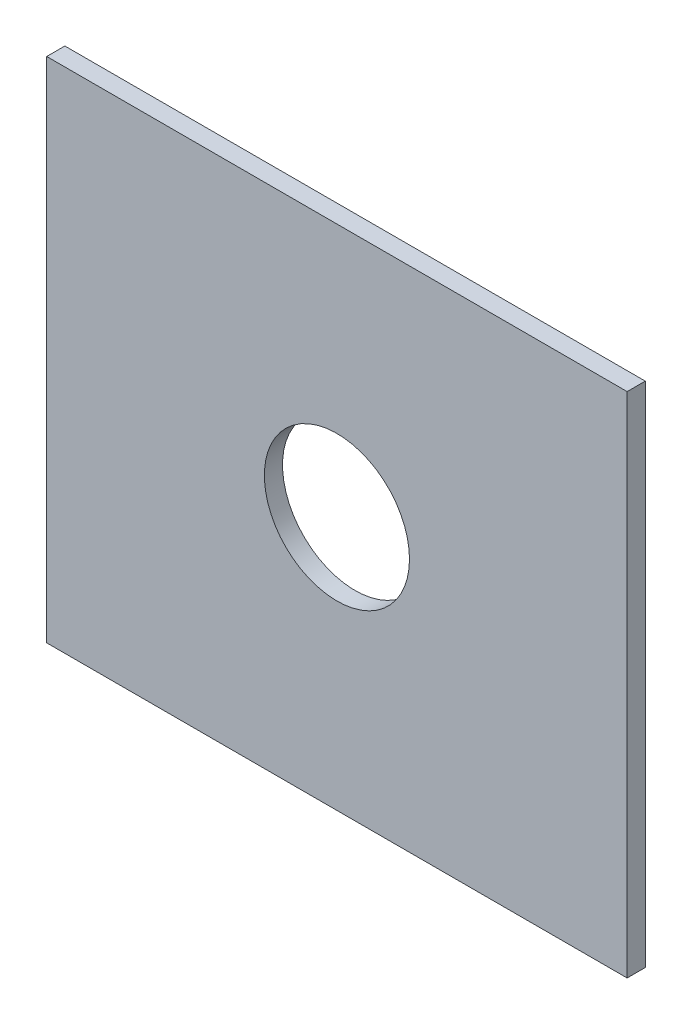
ISO-10303-21;
HEADER;
FILE_DESCRIPTION(('STEP AP214'),'2;1');
FILE_NAME('part.step','',(''),(''),'','','');
FILE_SCHEMA(('AUTOMOTIVE_DESIGN { 1 0 10303 214 1 1 1 1 }'));
ENDSEC;
DATA;
#1=APPLICATION_CONTEXT('core data for automotive mechanical design processes');
#2=APPLICATION_PROTOCOL_DEFINITION('international standard','automotive_design',2000,#1);
#3=PRODUCT_CONTEXT('',#1,'mechanical');
#4=PRODUCT('Part','Part','',(#3));
#5=PRODUCT_RELATED_PRODUCT_CATEGORY('part','',(#4));
#6=PRODUCT_DEFINITION_FORMATION('','',#4);
#7=PRODUCT_DEFINITION_CONTEXT('part definition',#1,'design');
#8=PRODUCT_DEFINITION('design','',#6,#7);
#9=PRODUCT_DEFINITION_SHAPE('','',#8);
#10=(LENGTH_UNIT() NAMED_UNIT(*) SI_UNIT(.MILLI.,.METRE.));
#11=(NAMED_UNIT(*) PLANE_ANGLE_UNIT() SI_UNIT($,.RADIAN.));
#12=(NAMED_UNIT(*) SI_UNIT($,.STERADIAN.) SOLID_ANGLE_UNIT());
#13=UNCERTAINTY_MEASURE_WITH_UNIT(LENGTH_MEASURE(1.E-05),#10,'distance_accuracy_value','');
#14=(GEOMETRIC_REPRESENTATION_CONTEXT(3) GLOBAL_UNCERTAINTY_ASSIGNED_CONTEXT((#13)) GLOBAL_UNIT_ASSIGNED_CONTEXT((#10,
#11,#12)) REPRESENTATION_CONTEXT('',''));
#15=CARTESIAN_POINT('',(0.,0.,0.));
#16=DIRECTION('',(0.,0.,1.));
#17=DIRECTION('',(1.,0.,0.));
#18=AXIS2_PLACEMENT_3D('',#15,#16,#17);
#19=CARTESIAN_POINT('',(25.4,11.1125,1.5875));
#20=DIRECTION('',(-1.,0.,0.));
#21=DIRECTION('',(0.,-1.,0.));
#22=AXIS2_PLACEMENT_3D('',#19,#20,#21);
#23=PLANE('',#22);
#24=DIRECTION('',(0.,1.,0.));
#25=VECTOR('',#24,1.);
#26=CARTESIAN_POINT('',(25.4,11.1125,0.));
#27=LINE('',#26,#25);
#28=CARTESIAN_POINT('',(25.4,11.1125,0.));
#29=VERTEX_POINT('',#28);
#30=CARTESIAN_POINT('',(25.4,55.5625,0.));
#31=VERTEX_POINT('',#30);
#32=EDGE_CURVE('E94',#29,#31,#27,.T.);
#33=ORIENTED_EDGE('',*,*,#32,.T.);
#34=DIRECTION('',(0.,0.,-1.));
#35=VECTOR('',#34,1.);
#36=CARTESIAN_POINT('',(25.4,55.5625,1.5875));
#37=LINE('',#36,#35);
#38=CARTESIAN_POINT('',(25.4,55.5625,1.5875));
#39=VERTEX_POINT('',#38);
#40=EDGE_CURVE('E11',#39,#31,#37,.T.);
#41=ORIENTED_EDGE('',*,*,#40,.F.);
#42=DIRECTION('',(0.,1.,0.));
#43=VECTOR('',#42,1.);
#44=CARTESIAN_POINT('',(25.4,11.1125,1.5875));
#45=LINE('',#44,#43);
#46=CARTESIAN_POINT('',(25.4,11.1125,1.5875));
#47=VERTEX_POINT('',#46);
#48=EDGE_CURVE('E82',#47,#39,#45,.T.);
#49=ORIENTED_EDGE('',*,*,#48,.F.);
#50=DIRECTION('',(0.,0.,-1.));
#51=VECTOR('',#50,1.);
#52=CARTESIAN_POINT('',(25.4,11.1125,1.5875));
#53=LINE('',#52,#51);
#54=EDGE_CURVE('E90',#47,#29,#53,.T.);
#55=ORIENTED_EDGE('',*,*,#54,.T.);
#56=EDGE_LOOP('',(#33,#41,#49,#55));
#57=FACE_BOUND('',#56,.T.);
#58=ADVANCED_FACE('F31',(#57),#23,.F.);
#59=CARTESIAN_POINT('',(25.4,55.5625,1.5875));
#60=DIRECTION('',(0.,-1.,0.));
#61=DIRECTION('',(0.,0.,-1.));
#62=AXIS2_PLACEMENT_3D('',#59,#60,#61);
#63=PLANE('',#62);
#64=DIRECTION('',(-1.,0.,0.));
#65=VECTOR('',#64,1.);
#66=CARTESIAN_POINT('',(25.4,55.5625,0.));
#67=LINE('',#66,#65);
#68=CARTESIAN_POINT('',(-25.4,55.5625,0.));
#69=VERTEX_POINT('',#68);
#70=EDGE_CURVE('E86',#31,#69,#67,.T.);
#71=ORIENTED_EDGE('',*,*,#70,.T.);
#72=DIRECTION('',(0.,0.,-1.));
#73=VECTOR('',#72,1.);
#74=CARTESIAN_POINT('',(-25.4,55.5625,1.5875));
#75=LINE('',#74,#73);
#76=CARTESIAN_POINT('',(-25.4,55.5625,1.5875));
#77=VERTEX_POINT('',#76);
#78=EDGE_CURVE('E39',#77,#69,#75,.T.);
#79=ORIENTED_EDGE('',*,*,#78,.F.);
#80=DIRECTION('',(-1.,0.,0.));
#81=VECTOR('',#80,1.);
#82=CARTESIAN_POINT('',(25.4,55.5625,1.5875));
#83=LINE('',#82,#81);
#84=EDGE_CURVE('E77',#39,#77,#83,.T.);
#85=ORIENTED_EDGE('',*,*,#84,.F.);
#86=ORIENTED_EDGE('',*,*,#40,.T.);
#87=EDGE_LOOP('',(#71,#79,#85,#86));
#88=FACE_BOUND('',#87,.T.);
#89=ADVANCED_FACE('F85',(#88),#63,.F.);
#90=CARTESIAN_POINT('',(-25.4,11.1125,1.5875));
#91=DIRECTION('',(1.,0.,0.));
#92=DIRECTION('',(0.,1.,0.));
#93=AXIS2_PLACEMENT_3D('',#90,#91,#92);
#94=PLANE('',#93);
#95=DIRECTION('',(0.,-1.,0.));
#96=VECTOR('',#95,1.);
#97=CARTESIAN_POINT('',(-25.4,11.1125,0.));
#98=LINE('',#97,#96);
#99=CARTESIAN_POINT('',(-25.4,11.1125,0.));
#100=VERTEX_POINT('',#99);
#101=EDGE_CURVE('E64',#69,#100,#98,.T.);
#102=ORIENTED_EDGE('',*,*,#101,.T.);
#103=DIRECTION('',(0.,0.,-1.));
#104=VECTOR('',#103,1.);
#105=CARTESIAN_POINT('',(-25.4,11.1125,1.5875));
#106=LINE('',#105,#104);
#107=CARTESIAN_POINT('',(-25.4,11.1125,1.5875));
#108=VERTEX_POINT('',#107);
#109=EDGE_CURVE('E87',#108,#100,#106,.T.);
#110=ORIENTED_EDGE('',*,*,#109,.F.);
#111=DIRECTION('',(0.,-1.,0.));
#112=VECTOR('',#111,1.);
#113=CARTESIAN_POINT('',(-25.4,11.1125,1.5875));
#114=LINE('',#113,#112);
#115=EDGE_CURVE('E80',#77,#108,#114,.T.);
#116=ORIENTED_EDGE('',*,*,#115,.F.);
#117=ORIENTED_EDGE('',*,*,#78,.T.);
#118=EDGE_LOOP('',(#102,#110,#116,#117));
#119=FACE_BOUND('',#118,.T.);
#120=ADVANCED_FACE('F88',(#119),#94,.F.);
#121=CARTESIAN_POINT('',(25.4,11.1125,1.5875));
#122=DIRECTION('',(0.,1.,0.));
#123=DIRECTION('',(-1.,0.,0.));
#124=AXIS2_PLACEMENT_3D('',#121,#122,#123);
#125=PLANE('',#124);
#126=DIRECTION('',(1.,0.,0.));
#127=VECTOR('',#126,1.);
#128=CARTESIAN_POINT('',(25.4,11.1125,0.));
#129=LINE('',#128,#127);
#130=EDGE_CURVE('E70',#100,#29,#129,.T.);
#131=ORIENTED_EDGE('',*,*,#130,.T.);
#132=ORIENTED_EDGE('',*,*,#54,.F.);
#133=DIRECTION('',(1.,0.,0.));
#134=VECTOR('',#133,1.);
#135=CARTESIAN_POINT('',(25.4,11.1125,1.5875));
#136=LINE('',#135,#134);
#137=EDGE_CURVE('E47',#108,#47,#136,.T.);
#138=ORIENTED_EDGE('',*,*,#137,.F.);
#139=ORIENTED_EDGE('',*,*,#109,.T.);
#140=EDGE_LOOP('',(#131,#132,#138,#139));
#141=FACE_BOUND('',#140,.T.);
#142=ADVANCED_FACE('F102',(#141),#125,.F.);
#143=CARTESIAN_POINT('',(25.4,11.1125,1.5875));
#144=DIRECTION('',(0.,0.,1.));
#145=DIRECTION('',(1.,0.,0.));
#146=AXIS2_PLACEMENT_3D('',#143,#144,#145);
#147=PLANE('',#146);
#148=CARTESIAN_POINT('',(0.,33.3375,1.5875));
#149=DIRECTION('',(0.,0.,1.));
#150=DIRECTION('',(1.,0.,0.));
#151=AXIS2_PLACEMENT_3D('',#148,#149,#150);
#152=CIRCLE('',#151,6.35);
#153=CARTESIAN_POINT('',(6.34999999999998,33.3375,1.5875));
#154=VERTEX_POINT('',#153);
#155=EDGE_CURVE('E108',#154,#154,#152,.T.);
#156=ORIENTED_EDGE('',*,*,#155,.F.);
#157=EDGE_LOOP('',(#156));
#158=FACE_BOUND('',#157,.T.);
#159=ORIENTED_EDGE('',*,*,#48,.T.);
#160=ORIENTED_EDGE('',*,*,#84,.T.);
#161=ORIENTED_EDGE('',*,*,#115,.T.);
#162=ORIENTED_EDGE('',*,*,#137,.T.);
#163=EDGE_LOOP('',(#159,#160,#161,#162));
#164=FACE_BOUND('',#163,.T.);
#165=ADVANCED_FACE('F78',(#158,#164),#147,.T.);
#166=CARTESIAN_POINT('',(25.4,11.1125,0.));
#167=DIRECTION('',(0.,0.,1.));
#168=DIRECTION('',(1.,0.,0.));
#169=AXIS2_PLACEMENT_3D('',#166,#167,#168);
#170=PLANE('',#169);
#171=CARTESIAN_POINT('',(0.,33.3375,0.));
#172=DIRECTION('',(0.,0.,1.));
#173=DIRECTION('',(1.,0.,0.));
#174=AXIS2_PLACEMENT_3D('',#171,#172,#173);
#175=CIRCLE('',#174,6.35);
#176=CARTESIAN_POINT('',(6.34999999999998,33.3375,0.));
#177=VERTEX_POINT('',#176);
#178=EDGE_CURVE('E97',#177,#177,#175,.T.);
#179=ORIENTED_EDGE('',*,*,#178,.T.);
#180=EDGE_LOOP('',(#179));
#181=FACE_BOUND('',#180,.T.);
#182=ORIENTED_EDGE('',*,*,#32,.F.);
#183=ORIENTED_EDGE('',*,*,#130,.F.);
#184=ORIENTED_EDGE('',*,*,#101,.F.);
#185=ORIENTED_EDGE('',*,*,#70,.F.);
#186=EDGE_LOOP('',(#182,#183,#184,#185));
#187=FACE_BOUND('',#186,.T.);
#188=ADVANCED_FACE('F105',(#181,#187),#170,.F.);
#189=CARTESIAN_POINT('',(0.,33.3375,0.));
#190=DIRECTION('',(0.,0.,1.));
#191=DIRECTION('',(1.,0.,0.));
#192=AXIS2_PLACEMENT_3D('',#189,#190,#191);
#193=CYLINDRICAL_SURFACE('',#192,6.35);
#194=ORIENTED_EDGE('',*,*,#178,.F.);
#195=EDGE_LOOP('',(#194));
#196=FACE_BOUND('',#195,.T.);
#197=ORIENTED_EDGE('',*,*,#155,.T.);
#198=EDGE_LOOP('',(#197));
#199=FACE_BOUND('',#198,.T.);
#200=ADVANCED_FACE('F115',(#196,#199),#193,.F.);
#201=CLOSED_SHELL('',(#58,#89,#120,#142,#165,#188,#200));
#202=MANIFOLD_SOLID_BREP('B2',#201);
#203=ADVANCED_BREP_SHAPE_REPRESENTATION('',(#18,#202),#14);
#204=SHAPE_DEFINITION_REPRESENTATION(#9,#203);
ENDSEC;
END-ISO-10303-21;
